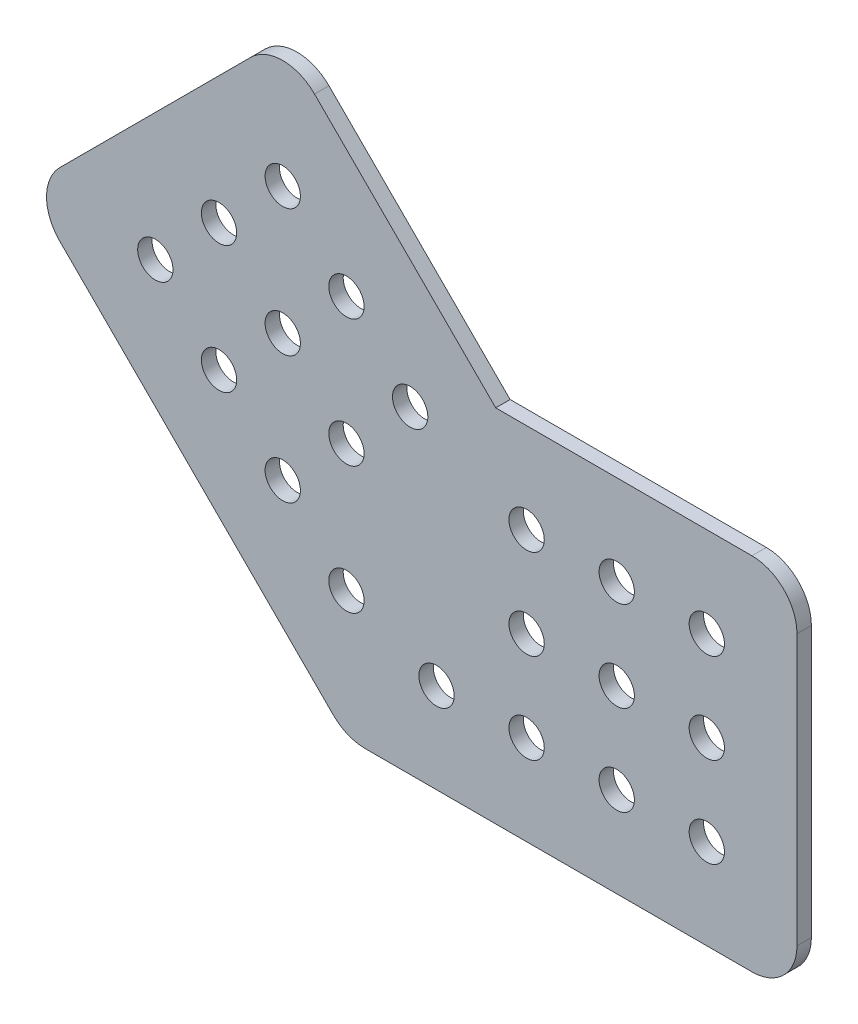
ISO-10303-21;
HEADER;
FILE_DESCRIPTION(('STEP AP214'),'2;1');
FILE_NAME('part.step','',(''),(''),'','','');
FILE_SCHEMA(('AUTOMOTIVE_DESIGN { 1 0 10303 214 1 1 1 1 }'));
ENDSEC;
DATA;
#1=APPLICATION_CONTEXT('core data for automotive mechanical design processes');
#2=APPLICATION_PROTOCOL_DEFINITION('international standard','automotive_design',2000,#1);
#3=PRODUCT_CONTEXT('',#1,'mechanical');
#4=PRODUCT('Part','Part','',(#3));
#5=PRODUCT_RELATED_PRODUCT_CATEGORY('part','',(#4));
#6=PRODUCT_DEFINITION_FORMATION('','',#4);
#7=PRODUCT_DEFINITION_CONTEXT('part definition',#1,'design');
#8=PRODUCT_DEFINITION('design','',#6,#7);
#9=PRODUCT_DEFINITION_SHAPE('','',#8);
#10=(LENGTH_UNIT() NAMED_UNIT(*) SI_UNIT(.MILLI.,.METRE.));
#11=(NAMED_UNIT(*) PLANE_ANGLE_UNIT() SI_UNIT($,.RADIAN.));
#12=(NAMED_UNIT(*) SI_UNIT($,.STERADIAN.) SOLID_ANGLE_UNIT());
#13=UNCERTAINTY_MEASURE_WITH_UNIT(LENGTH_MEASURE(1.E-05),#10,'distance_accuracy_value','');
#14=(GEOMETRIC_REPRESENTATION_CONTEXT(3) GLOBAL_UNCERTAINTY_ASSIGNED_CONTEXT((#13)) GLOBAL_UNIT_ASSIGNED_CONTEXT((#10,
#11,#12)) REPRESENTATION_CONTEXT('',''));
#15=CARTESIAN_POINT('',(0.,0.,0.));
#16=DIRECTION('',(0.,0.,1.));
#17=DIRECTION('',(1.,0.,0.));
#18=AXIS2_PLACEMENT_3D('',#15,#16,#17);
#19=CARTESIAN_POINT('',(-49.161175251051,34.6431769044228,0.));
#20=DIRECTION('',(0.,0.,1.));
#21=DIRECTION('',(1.,0.,0.));
#22=AXIS2_PLACEMENT_3D('',#19,#20,#21);
#23=PLANE('',#22);
#24=CARTESIAN_POINT('',(-63.5108489685532,53.8815367264149,0.));
#25=DIRECTION('',(0.,0.,-1.));
#26=DIRECTION('',(-1.,0.,0.));
#27=AXIS2_PLACEMENT_3D('',#24,#25,#26);
#28=CIRCLE('',#27,2.4892);
#29=CARTESIAN_POINT('',(-66.0000489685532,53.8815367264149,0.));
#30=VERTEX_POINT('',#29);
#31=EDGE_CURVE('E113',#30,#30,#28,.F.);
#32=ORIENTED_EDGE('',*,*,#31,.T.);
#33=EDGE_LOOP('',(#32));
#34=FACE_BOUND('',#33,.T.);
#35=CARTESIAN_POINT('',(-72.4911050896226,62.8617928474842,0.));
#36=DIRECTION('',(0.,0.,-1.));
#37=DIRECTION('',(-1.,0.,0.));
#38=AXIS2_PLACEMENT_3D('',#35,#36,#37);
#39=CIRCLE('',#38,2.4892);
#40=CARTESIAN_POINT('',(-74.9803050896225,62.8617928474842,0.));
#41=VERTEX_POINT('',#40);
#42=EDGE_CURVE('E116',#41,#41,#39,.F.);
#43=ORIENTED_EDGE('',*,*,#42,.T.);
#44=EDGE_LOOP('',(#43));
#45=FACE_BOUND('',#44,.T.);
#46=CARTESIAN_POINT('',(-54.5305928474842,44.9012806053458,0.));
#47=DIRECTION('',(0.,0.,-1.));
#48=DIRECTION('',(-1.,0.,0.));
#49=AXIS2_PLACEMENT_3D('',#46,#47,#48);
#50=CIRCLE('',#49,2.4892);
#51=CARTESIAN_POINT('',(-57.0197928474842,44.9012806053458,0.));
#52=VERTEX_POINT('',#51);
#53=EDGE_CURVE('E269',#52,#52,#50,.F.);
#54=ORIENTED_EDGE('',*,*,#53,.T.);
#55=EDGE_LOOP('',(#54));
#56=FACE_BOUND('',#55,.T.);
#57=CARTESIAN_POINT('',(-72.4911050896223,44.9012806053458,0.));
#58=DIRECTION('',(0.,0.,-1.));
#59=DIRECTION('',(-1.,0.,0.));
#60=AXIS2_PLACEMENT_3D('',#57,#58,#59);
#61=CIRCLE('',#60,2.4892);
#62=CARTESIAN_POINT('',(-74.9803050896223,44.9012806053458,0.));
#63=VERTEX_POINT('',#62);
#64=EDGE_CURVE('E266',#63,#63,#61,.F.);
#65=ORIENTED_EDGE('',*,*,#64,.T.);
#66=EDGE_LOOP('',(#65));
#67=FACE_BOUND('',#66,.T.);
#68=CARTESIAN_POINT('',(-90.4516173317607,44.9012806053458,0.));
#69=DIRECTION('',(0.,0.,-1.));
#70=DIRECTION('',(-1.,0.,0.));
#71=AXIS2_PLACEMENT_3D('',#68,#69,#70);
#72=CIRCLE('',#71,2.4892);
#73=CARTESIAN_POINT('',(-92.9408173317607,44.9012806053458,0.));
#74=VERTEX_POINT('',#73);
#75=EDGE_CURVE('E263',#74,#74,#72,.F.);
#76=ORIENTED_EDGE('',*,*,#75,.T.);
#77=EDGE_LOOP('',(#76));
#78=FACE_BOUND('',#77,.T.);
#79=CARTESIAN_POINT('',(-72.4911050896223,26.9407683632074,0.));
#80=DIRECTION('',(0.,0.,-1.));
#81=DIRECTION('',(-1.,0.,0.));
#82=AXIS2_PLACEMENT_3D('',#79,#80,#81);
#83=CIRCLE('',#82,2.4892);
#84=CARTESIAN_POINT('',(-74.9803050896223,26.9407683632074,0.));
#85=VERTEX_POINT('',#84);
#86=EDGE_CURVE('E260',#85,#85,#83,.F.);
#87=ORIENTED_EDGE('',*,*,#86,.T.);
#88=EDGE_LOOP('',(#87));
#89=FACE_BOUND('',#88,.T.);
#90=CARTESIAN_POINT('',(-63.5108489685532,17.9605122421383,0.));
#91=DIRECTION('',(0.,0.,-1.));
#92=DIRECTION('',(-1.,0.,0.));
#93=AXIS2_PLACEMENT_3D('',#90,#91,#92);
#94=CIRCLE('',#93,2.4892);
#95=CARTESIAN_POINT('',(-66.0000489685532,17.9605122421383,0.));
#96=VERTEX_POINT('',#95);
#97=EDGE_CURVE('E257',#96,#96,#94,.F.);
#98=ORIENTED_EDGE('',*,*,#97,.T.);
#99=EDGE_LOOP('',(#98));
#100=FACE_BOUND('',#99,.T.);
#101=CARTESIAN_POINT('',(-81.4713612106916,35.9210244842765,0.));
#102=DIRECTION('',(0.,0.,-1.));
#103=DIRECTION('',(-1.,0.,0.));
#104=AXIS2_PLACEMENT_3D('',#101,#102,#103);
#105=CIRCLE('',#104,2.4892);
#106=CARTESIAN_POINT('',(-83.9605612106916,35.9210244842765,0.));
#107=VERTEX_POINT('',#106);
#108=EDGE_CURVE('E254',#107,#107,#105,.F.);
#109=ORIENTED_EDGE('',*,*,#108,.T.);
#110=EDGE_LOOP('',(#109));
#111=FACE_BOUND('',#110,.T.);
#112=CARTESIAN_POINT('',(-63.5108489685532,35.9210244842765,0.));
#113=DIRECTION('',(0.,0.,-1.));
#114=DIRECTION('',(-1.,0.,0.));
#115=AXIS2_PLACEMENT_3D('',#112,#113,#114);
#116=CIRCLE('',#115,2.4892);
#117=CARTESIAN_POINT('',(-66.0000489685532,35.9210244842765,0.));
#118=VERTEX_POINT('',#117);
#119=EDGE_CURVE('E251',#118,#118,#116,.F.);
#120=ORIENTED_EDGE('',*,*,#119,.T.);
#121=EDGE_LOOP('',(#120));
#122=FACE_BOUND('',#121,.T.);
#123=CARTESIAN_POINT('',(-81.4713612106916,53.8815367264149,0.));
#124=DIRECTION('',(0.,0.,-1.));
#125=DIRECTION('',(-1.,0.,0.));
#126=AXIS2_PLACEMENT_3D('',#123,#124,#125);
#127=CIRCLE('',#126,2.4892);
#128=CARTESIAN_POINT('',(-83.9605612106916,53.8815367264149,0.));
#129=VERTEX_POINT('',#128);
#130=EDGE_CURVE('E248',#129,#129,#127,.F.);
#131=ORIENTED_EDGE('',*,*,#130,.T.);
#132=EDGE_LOOP('',(#131));
#133=FACE_BOUND('',#132,.T.);
#134=CARTESIAN_POINT('',(-25.4108489685532,38.1,0.));
#135=DIRECTION('',(0.,0.,1.));
#136=DIRECTION('',(1.,0.,0.));
#137=AXIS2_PLACEMENT_3D('',#134,#135,#136);
#138=CIRCLE('',#137,2.4892);
#139=CARTESIAN_POINT('',(-22.9216489685532,38.1,0.));
#140=VERTEX_POINT('',#139);
#141=EDGE_CURVE('E245',#140,#140,#138,.T.);
#142=ORIENTED_EDGE('',*,*,#141,.T.);
#143=EDGE_LOOP('',(#142));
#144=FACE_BOUND('',#143,.T.);
#145=CARTESIAN_POINT('',(-12.7108489685532,25.4,0.));
#146=DIRECTION('',(0.,0.,1.));
#147=DIRECTION('',(1.,0.,0.));
#148=AXIS2_PLACEMENT_3D('',#145,#146,#147);
#149=CIRCLE('',#148,2.4892);
#150=CARTESIAN_POINT('',(-10.2216489685532,25.4,0.));
#151=VERTEX_POINT('',#150);
#152=EDGE_CURVE('E242',#151,#151,#149,.T.);
#153=ORIENTED_EDGE('',*,*,#152,.T.);
#154=EDGE_LOOP('',(#153));
#155=FACE_BOUND('',#154,.T.);
#156=CARTESIAN_POINT('',(-38.1108489685532,25.4,0.));
#157=DIRECTION('',(0.,0.,1.));
#158=DIRECTION('',(1.,0.,0.));
#159=AXIS2_PLACEMENT_3D('',#156,#157,#158);
#160=CIRCLE('',#159,2.4892);
#161=CARTESIAN_POINT('',(-35.6216489685532,25.4,0.));
#162=VERTEX_POINT('',#161);
#163=EDGE_CURVE('E239',#162,#162,#160,.T.);
#164=ORIENTED_EDGE('',*,*,#163,.T.);
#165=EDGE_LOOP('',(#164));
#166=FACE_BOUND('',#165,.T.);
#167=CARTESIAN_POINT('',(-25.4108489685532,12.7,0.));
#168=DIRECTION('',(0.,0.,1.));
#169=DIRECTION('',(1.,0.,0.));
#170=AXIS2_PLACEMENT_3D('',#167,#168,#169);
#171=CIRCLE('',#170,2.4892);
#172=CARTESIAN_POINT('',(-22.9216489685532,12.7,0.));
#173=VERTEX_POINT('',#172);
#174=EDGE_CURVE('E236',#173,#173,#171,.T.);
#175=ORIENTED_EDGE('',*,*,#174,.T.);
#176=EDGE_LOOP('',(#175));
#177=FACE_BOUND('',#176,.T.);
#178=CARTESIAN_POINT('',(-50.8108489685532,12.7,0.));
#179=DIRECTION('',(0.,0.,1.));
#180=DIRECTION('',(1.,0.,0.));
#181=AXIS2_PLACEMENT_3D('',#178,#179,#180);
#182=CIRCLE('',#181,2.4892);
#183=CARTESIAN_POINT('',(-48.3216489685532,12.7,0.));
#184=VERTEX_POINT('',#183);
#185=EDGE_CURVE('E233',#184,#184,#182,.T.);
#186=ORIENTED_EDGE('',*,*,#185,.T.);
#187=EDGE_LOOP('',(#186));
#188=FACE_BOUND('',#187,.T.);
#189=CARTESIAN_POINT('',(-38.1108489685532,12.7,0.));
#190=DIRECTION('',(0.,0.,1.));
#191=DIRECTION('',(1.,0.,0.));
#192=AXIS2_PLACEMENT_3D('',#189,#190,#191);
#193=CIRCLE('',#192,2.4892);
#194=CARTESIAN_POINT('',(-35.6216489685532,12.7,0.));
#195=VERTEX_POINT('',#194);
#196=EDGE_CURVE('E230',#195,#195,#193,.T.);
#197=ORIENTED_EDGE('',*,*,#196,.T.);
#198=EDGE_LOOP('',(#197));
#199=FACE_BOUND('',#198,.T.);
#200=CARTESIAN_POINT('',(-12.7108489685532,12.7,0.));
#201=DIRECTION('',(0.,0.,1.));
#202=DIRECTION('',(1.,0.,0.));
#203=AXIS2_PLACEMENT_3D('',#200,#201,#202);
#204=CIRCLE('',#203,2.4892);
#205=CARTESIAN_POINT('',(-10.2216489685532,12.7,0.));
#206=VERTEX_POINT('',#205);
#207=EDGE_CURVE('E227',#206,#206,#204,.T.);
#208=ORIENTED_EDGE('',*,*,#207,.T.);
#209=EDGE_LOOP('',(#208));
#210=FACE_BOUND('',#209,.T.);
#211=CARTESIAN_POINT('',(-25.4108489685532,25.4,0.));
#212=DIRECTION('',(0.,0.,1.));
#213=DIRECTION('',(1.,0.,0.));
#214=AXIS2_PLACEMENT_3D('',#211,#212,#213);
#215=CIRCLE('',#214,2.4892);
#216=CARTESIAN_POINT('',(-22.9216489685532,25.4,0.));
#217=VERTEX_POINT('',#216);
#218=EDGE_CURVE('E224',#217,#217,#215,.T.);
#219=ORIENTED_EDGE('',*,*,#218,.T.);
#220=EDGE_LOOP('',(#219));
#221=FACE_BOUND('',#220,.T.);
#222=CARTESIAN_POINT('',(-38.1108489685532,38.1,0.));
#223=DIRECTION('',(0.,0.,1.));
#224=DIRECTION('',(1.,0.,0.));
#225=AXIS2_PLACEMENT_3D('',#222,#223,#224);
#226=CIRCLE('',#225,2.4892);
#227=CARTESIAN_POINT('',(-35.6216489685532,38.1,0.));
#228=VERTEX_POINT('',#227);
#229=EDGE_CURVE('E221',#228,#228,#226,.T.);
#230=ORIENTED_EDGE('',*,*,#229,.T.);
#231=EDGE_LOOP('',(#230));
#232=FACE_BOUND('',#231,.T.);
#233=CARTESIAN_POINT('',(-12.7108489685532,38.1,0.));
#234=DIRECTION('',(0.,0.,1.));
#235=DIRECTION('',(1.,0.,0.));
#236=AXIS2_PLACEMENT_3D('',#233,#234,#235);
#237=CIRCLE('',#236,2.4892);
#238=CARTESIAN_POINT('',(-10.2216489685532,38.1,0.));
#239=VERTEX_POINT('',#238);
#240=EDGE_CURVE('E218',#239,#239,#237,.T.);
#241=ORIENTED_EDGE('',*,*,#240,.T.);
#242=EDGE_LOOP('',(#241));
#243=FACE_BOUND('',#242,.T.);
#244=DIRECTION('',(0.,1.,0.));
#245=VECTOR('',#244,1.);
#246=CARTESIAN_POINT('',(0.,0.,0.));
#247=LINE('',#246,#245);
#248=CARTESIAN_POINT('',(0.,6.35,0.));
#249=VERTEX_POINT('',#248);
#250=CARTESIAN_POINT('',(0.,44.45,0.));
#251=VERTEX_POINT('',#250);
#252=EDGE_CURVE('E96',#249,#251,#247,.T.);
#253=ORIENTED_EDGE('',*,*,#252,.F.);
#254=CARTESIAN_POINT('',(-6.35,6.35,0.));
#255=DIRECTION('',(0.,0.,1.));
#256=DIRECTION('',(1.,0.,0.));
#257=AXIS2_PLACEMENT_3D('',#254,#255,#256);
#258=CIRCLE('',#257,6.35);
#259=CARTESIAN_POINT('',(-6.35,0.,0.));
#260=VERTEX_POINT('',#259);
#261=EDGE_CURVE('E110',#260,#249,#258,.T.);
#262=ORIENTED_EDGE('',*,*,#261,.F.);
#263=DIRECTION('',(1.,0.,0.));
#264=VECTOR('',#263,1.);
#265=CARTESIAN_POINT('',(-63.5108489685532,0.,0.));
#266=LINE('',#265,#264);
#267=CARTESIAN_POINT('',(-60.8805928474839,0.,0.));
#268=VERTEX_POINT('',#267);
#269=EDGE_CURVE('E122',#268,#260,#266,.T.);
#270=ORIENTED_EDGE('',*,*,#269,.F.);
#271=CARTESIAN_POINT('',(-60.8805928474839,6.34999999999997,0.));
#272=DIRECTION('',(0.,0.,1.));
#273=DIRECTION('',(1.,0.,0.));
#274=AXIS2_PLACEMENT_3D('',#271,#272,#273);
#275=CIRCLE('',#274,6.35);
#276=CARTESIAN_POINT('',(-65.3707209080185,1.8598719394654,0.));
#277=VERTEX_POINT('',#276);
#278=EDGE_CURVE('E275',#277,#268,#275,.T.);
#279=ORIENTED_EDGE('',*,*,#278,.F.);
#280=DIRECTION('',(0.707106781186548,-0.707106781186547,0.));
#281=VECTOR('',#280,1.);
#282=CARTESIAN_POINT('',(-108.419800953132,44.9089519845786,0.));
#283=LINE('',#282,#281);
#284=CARTESIAN_POINT('',(-103.929672892597,40.418823924044,0.));
#285=VERTEX_POINT('',#284);
#286=EDGE_CURVE('E126',#285,#277,#283,.T.);
#287=ORIENTED_EDGE('',*,*,#286,.F.);
#288=CARTESIAN_POINT('',(-99.4395448320627,44.9089519845786,0.));
#289=DIRECTION('',(0.,0.,1.));
#290=DIRECTION('',(1.,0.,0.));
#291=AXIS2_PLACEMENT_3D('',#288,#289,#290);
#292=CIRCLE('',#291,6.35);
#293=CARTESIAN_POINT('',(-103.929672892597,49.3990800451132,0.));
#294=VERTEX_POINT('',#293);
#295=EDGE_CURVE('E277',#294,#285,#292,.T.);
#296=ORIENTED_EDGE('',*,*,#295,.F.);
#297=DIRECTION('',(-0.707106781186547,-0.707106781186548,0.));
#298=VECTOR('',#297,1.);
#299=CARTESIAN_POINT('',(-72.4987764688553,80.8299764688553,0.));
#300=LINE('',#299,#298);
#301=CARTESIAN_POINT('',(-76.98890452939,76.3398484083206,0.));
#302=VERTEX_POINT('',#301);
#303=EDGE_CURVE('E130',#302,#294,#300,.T.);
#304=ORIENTED_EDGE('',*,*,#303,.F.);
#305=CARTESIAN_POINT('',(-72.4987764688553,71.849720347786,0.));
#306=DIRECTION('',(0.,0.,1.));
#307=DIRECTION('',(1.,0.,0.));
#308=AXIS2_PLACEMENT_3D('',#305,#306,#307);
#309=CIRCLE('',#308,6.35);
#310=CARTESIAN_POINT('',(-68.0086484083207,76.3398484083206,0.));
#311=VERTEX_POINT('',#310);
#312=EDGE_CURVE('E278',#311,#302,#309,.T.);
#313=ORIENTED_EDGE('',*,*,#312,.F.);
#314=DIRECTION('',(-0.707106781186548,0.707106781186547,0.));
#315=VECTOR('',#314,1.);
#316=CARTESIAN_POINT('',(-42.4688,50.8,0.));
#317=LINE('',#316,#315);
#318=CARTESIAN_POINT('',(-42.4688,50.8,0.));
#319=VERTEX_POINT('',#318);
#320=EDGE_CURVE('E134',#319,#311,#317,.T.);
#321=ORIENTED_EDGE('',*,*,#320,.F.);
#322=DIRECTION('',(1.,0.,0.));
#323=VECTOR('',#322,1.);
#324=CARTESIAN_POINT('',(0.,50.8,0.));
#325=LINE('',#324,#323);
#326=CARTESIAN_POINT('',(-6.35,50.8,0.));
#327=VERTEX_POINT('',#326);
#328=EDGE_CURVE('E99',#327,#319,#325,.F.);
#329=ORIENTED_EDGE('',*,*,#328,.F.);
#330=CARTESIAN_POINT('',(-6.35,44.45,0.));
#331=DIRECTION('',(0.,0.,1.));
#332=DIRECTION('',(1.,0.,0.));
#333=AXIS2_PLACEMENT_3D('',#330,#331,#332);
#334=CIRCLE('',#333,6.35);
#335=EDGE_CURVE('E18',#251,#327,#334,.T.);
#336=ORIENTED_EDGE('',*,*,#335,.F.);
#337=EDGE_LOOP('',(#253,#262,#270,#279,#287,#296,#304,#313,#321,#329,#336));
#338=FACE_BOUND('',#337,.T.);
#339=ADVANCED_FACE('F15',(#34,#45,#56,#67,#78,#89,#100,#111,#122,#133,#144,#155,#166,#177,#188,
#199,#210,#221,#232,#243,#338),#23,.F.);
#340=CARTESIAN_POINT('',(-6.35,44.45,0.));
#341=DIRECTION('',(0.,0.,1.));
#342=DIRECTION('',(1.,0.,0.));
#343=AXIS2_PLACEMENT_3D('',#340,#341,#342);
#344=CYLINDRICAL_SURFACE('',#343,6.35);
#345=ORIENTED_EDGE('',*,*,#335,.T.);
#346=DIRECTION('',(0.,0.,1.));
#347=VECTOR('',#346,1.);
#348=CARTESIAN_POINT('',(-6.35,50.8,0.));
#349=LINE('',#348,#347);
#350=CARTESIAN_POINT('',(-6.35,50.8,2.032));
#351=VERTEX_POINT('',#350);
#352=EDGE_CURVE('E102',#351,#327,#349,.F.);
#353=ORIENTED_EDGE('',*,*,#352,.F.);
#354=CARTESIAN_POINT('',(-6.35,44.45,2.032));
#355=DIRECTION('',(0.,0.,1.));
#356=DIRECTION('',(1.,0.,0.));
#357=AXIS2_PLACEMENT_3D('',#354,#355,#356);
#358=CIRCLE('',#357,6.35);
#359=CARTESIAN_POINT('',(0.,44.45,2.032));
#360=VERTEX_POINT('',#359);
#361=EDGE_CURVE('E107',#360,#351,#358,.T.);
#362=ORIENTED_EDGE('',*,*,#361,.F.);
#363=DIRECTION('',(0.,0.,-1.));
#364=VECTOR('',#363,1.);
#365=CARTESIAN_POINT('',(0.,44.45,0.));
#366=LINE('',#365,#364);
#367=EDGE_CURVE('E104',#251,#360,#366,.F.);
#368=ORIENTED_EDGE('',*,*,#367,.F.);
#369=EDGE_LOOP('',(#345,#353,#362,#368));
#370=FACE_BOUND('',#369,.T.);
#371=ADVANCED_FACE('F105',(#370),#344,.T.);
#372=CARTESIAN_POINT('',(0.,50.8,0.));
#373=DIRECTION('',(0.,1.,0.));
#374=DIRECTION('',(0.,0.,1.));
#375=AXIS2_PLACEMENT_3D('',#372,#373,#374);
#376=PLANE('',#375);
#377=DIRECTION('',(0.,0.,1.));
#378=VECTOR('',#377,1.);
#379=CARTESIAN_POINT('',(-42.4688,50.8,0.));
#380=LINE('',#379,#378);
#381=CARTESIAN_POINT('',(-42.4688,50.8,2.032));
#382=VERTEX_POINT('',#381);
#383=EDGE_CURVE('E137',#382,#319,#380,.F.);
#384=ORIENTED_EDGE('',*,*,#383,.F.);
#385=DIRECTION('',(1.,0.,0.));
#386=VECTOR('',#385,1.);
#387=CARTESIAN_POINT('',(-49.161175251051,50.8,2.032));
#388=LINE('',#387,#386);
#389=EDGE_CURVE('E217',#351,#382,#388,.F.);
#390=ORIENTED_EDGE('',*,*,#389,.F.);
#391=ORIENTED_EDGE('',*,*,#352,.T.);
#392=ORIENTED_EDGE('',*,*,#328,.T.);
#393=EDGE_LOOP('',(#384,#390,#391,#392));
#394=FACE_BOUND('',#393,.T.);
#395=ADVANCED_FACE('F299',(#394),#376,.T.);
#396=CARTESIAN_POINT('',(-42.4688,50.8,0.));
#397=DIRECTION('',(0.707106781186547,0.707106781186548,0.));
#398=DIRECTION('',(-0.707106781186548,0.707106781186547,0.));
#399=AXIS2_PLACEMENT_3D('',#396,#397,#398);
#400=PLANE('',#399);
#401=ORIENTED_EDGE('',*,*,#383,.T.);
#402=ORIENTED_EDGE('',*,*,#320,.T.);
#403=DIRECTION('',(0.,0.,1.));
#404=VECTOR('',#403,1.);
#405=CARTESIAN_POINT('',(-68.0086484083207,76.3398484083206,0.));
#406=LINE('',#405,#404);
#407=CARTESIAN_POINT('',(-68.0086484083207,76.3398484083206,2.032));
#408=VERTEX_POINT('',#407);
#409=EDGE_CURVE('E136',#408,#311,#406,.F.);
#410=ORIENTED_EDGE('',*,*,#409,.F.);
#411=DIRECTION('',(-0.707106781186547,0.707106781186548,0.));
#412=VECTOR('',#411,1.);
#413=CARTESIAN_POINT('',(-42.4688,50.8,2.032));
#414=LINE('',#413,#412);
#415=EDGE_CURVE('E215',#382,#408,#414,.T.);
#416=ORIENTED_EDGE('',*,*,#415,.F.);
#417=EDGE_LOOP('',(#401,#402,#410,#416));
#418=FACE_BOUND('',#417,.T.);
#419=ADVANCED_FACE('F294',(#418),#400,.T.);
#420=CARTESIAN_POINT('',(-72.4987764688553,71.849720347786,0.));
#421=DIRECTION('',(0.,0.,1.));
#422=DIRECTION('',(1.,0.,0.));
#423=AXIS2_PLACEMENT_3D('',#420,#421,#422);
#424=CYLINDRICAL_SURFACE('',#423,6.35);
#425=ORIENTED_EDGE('',*,*,#312,.T.);
#426=DIRECTION('',(0.,0.,1.));
#427=VECTOR('',#426,1.);
#428=CARTESIAN_POINT('',(-76.98890452939,76.3398484083207,0.));
#429=LINE('',#428,#427);
#430=CARTESIAN_POINT('',(-76.98890452939,76.3398484083207,2.032));
#431=VERTEX_POINT('',#430);
#432=EDGE_CURVE('E133',#431,#302,#429,.F.);
#433=ORIENTED_EDGE('',*,*,#432,.F.);
#434=CARTESIAN_POINT('',(-72.4987764688553,71.849720347786,2.032));
#435=DIRECTION('',(0.,0.,1.));
#436=DIRECTION('',(1.,0.,0.));
#437=AXIS2_PLACEMENT_3D('',#434,#435,#436);
#438=CIRCLE('',#437,6.35);
#439=EDGE_CURVE('E212',#408,#431,#438,.T.);
#440=ORIENTED_EDGE('',*,*,#439,.F.);
#441=ORIENTED_EDGE('',*,*,#409,.T.);
#442=EDGE_LOOP('',(#425,#433,#440,#441));
#443=FACE_BOUND('',#442,.T.);
#444=ADVANCED_FACE('F308',(#443),#424,.T.);
#445=CARTESIAN_POINT('',(-72.4987764688553,80.8299764688553,0.));
#446=DIRECTION('',(-0.707106781186548,0.707106781186547,0.));
#447=DIRECTION('',(-0.707106781186547,-0.707106781186548,0.));
#448=AXIS2_PLACEMENT_3D('',#445,#446,#447);
#449=PLANE('',#448);
#450=ORIENTED_EDGE('',*,*,#432,.T.);
#451=ORIENTED_EDGE('',*,*,#303,.T.);
#452=DIRECTION('',(0.,0.,1.));
#453=VECTOR('',#452,1.);
#454=CARTESIAN_POINT('',(-103.929672892597,49.3990800451132,0.));
#455=LINE('',#454,#453);
#456=CARTESIAN_POINT('',(-103.929672892597,49.3990800451132,2.032));
#457=VERTEX_POINT('',#456);
#458=EDGE_CURVE('E132',#457,#294,#455,.F.);
#459=ORIENTED_EDGE('',*,*,#458,.F.);
#460=DIRECTION('',(-0.707106781186547,-0.707106781186547,0.));
#461=VECTOR('',#460,1.);
#462=CARTESIAN_POINT('',(-76.98890452939,76.3398484083207,2.032));
#463=LINE('',#462,#461);
#464=EDGE_CURVE('E211',#431,#457,#463,.T.);
#465=ORIENTED_EDGE('',*,*,#464,.F.);
#466=EDGE_LOOP('',(#450,#451,#459,#465));
#467=FACE_BOUND('',#466,.T.);
#468=ADVANCED_FACE('F306',(#467),#449,.T.);
#469=CARTESIAN_POINT('',(-99.4395448320627,44.9089519845786,0.));
#470=DIRECTION('',(0.,0.,1.));
#471=DIRECTION('',(1.,0.,0.));
#472=AXIS2_PLACEMENT_3D('',#469,#470,#471);
#473=CYLINDRICAL_SURFACE('',#472,6.35);
#474=ORIENTED_EDGE('',*,*,#295,.T.);
#475=DIRECTION('',(0.,0.,1.));
#476=VECTOR('',#475,1.);
#477=CARTESIAN_POINT('',(-103.929672892597,40.418823924044,0.));
#478=LINE('',#477,#476);
#479=CARTESIAN_POINT('',(-103.929672892597,40.418823924044,2.032));
#480=VERTEX_POINT('',#479);
#481=EDGE_CURVE('E129',#480,#285,#478,.F.);
#482=ORIENTED_EDGE('',*,*,#481,.F.);
#483=CARTESIAN_POINT('',(-99.4395448320627,44.9089519845786,2.032));
#484=DIRECTION('',(0.,0.,1.));
#485=DIRECTION('',(1.,0.,0.));
#486=AXIS2_PLACEMENT_3D('',#483,#484,#485);
#487=CIRCLE('',#486,6.35);
#488=EDGE_CURVE('E208',#457,#480,#487,.T.);
#489=ORIENTED_EDGE('',*,*,#488,.F.);
#490=ORIENTED_EDGE('',*,*,#458,.T.);
#491=EDGE_LOOP('',(#474,#482,#489,#490));
#492=FACE_BOUND('',#491,.T.);
#493=ADVANCED_FACE('F329',(#492),#473,.T.);
#494=CARTESIAN_POINT('',(-108.419800953132,44.9089519845786,0.));
#495=DIRECTION('',(-0.707106781186547,-0.707106781186548,0.));
#496=DIRECTION('',(0.707106781186548,-0.707106781186547,0.));
#497=AXIS2_PLACEMENT_3D('',#494,#495,#496);
#498=PLANE('',#497);
#499=ORIENTED_EDGE('',*,*,#481,.T.);
#500=ORIENTED_EDGE('',*,*,#286,.T.);
#501=DIRECTION('',(0.,0.,1.));
#502=VECTOR('',#501,1.);
#503=CARTESIAN_POINT('',(-65.3707209080185,1.85987193946545,0.));
#504=LINE('',#503,#502);
#505=CARTESIAN_POINT('',(-65.3707209080185,1.8598719394654,2.032));
#506=VERTEX_POINT('',#505);
#507=EDGE_CURVE('E128',#506,#277,#504,.F.);
#508=ORIENTED_EDGE('',*,*,#507,.F.);
#509=DIRECTION('',(0.70710678118655,-0.707106781186545,0.));
#510=VECTOR('',#509,1.);
#511=CARTESIAN_POINT('',(-103.929672892597,40.4188239240439,2.032));
#512=LINE('',#511,#510);
#513=EDGE_CURVE('E207',#480,#506,#512,.T.);
#514=ORIENTED_EDGE('',*,*,#513,.F.);
#515=EDGE_LOOP('',(#499,#500,#508,#514));
#516=FACE_BOUND('',#515,.T.);
#517=ADVANCED_FACE('F345',(#516),#498,.T.);
#518=CARTESIAN_POINT('',(-60.8805928474839,6.34999999999997,0.));
#519=DIRECTION('',(0.,0.,1.));
#520=DIRECTION('',(1.,0.,0.));
#521=AXIS2_PLACEMENT_3D('',#518,#519,#520);
#522=CYLINDRICAL_SURFACE('',#521,6.35);
#523=ORIENTED_EDGE('',*,*,#278,.T.);
#524=DIRECTION('',(0.,0.,1.));
#525=VECTOR('',#524,1.);
#526=CARTESIAN_POINT('',(-60.8805928474839,0.,0.));
#527=LINE('',#526,#525);
#528=CARTESIAN_POINT('',(-60.8805928474839,0.,2.032));
#529=VERTEX_POINT('',#528);
#530=EDGE_CURVE('E125',#529,#268,#527,.F.);
#531=ORIENTED_EDGE('',*,*,#530,.F.);
#532=CARTESIAN_POINT('',(-60.8805928474839,6.34999999999997,2.032));
#533=DIRECTION('',(0.,0.,1.));
#534=DIRECTION('',(1.,0.,0.));
#535=AXIS2_PLACEMENT_3D('',#532,#533,#534);
#536=CIRCLE('',#535,6.35);
#537=EDGE_CURVE('E204',#506,#529,#536,.T.);
#538=ORIENTED_EDGE('',*,*,#537,.F.);
#539=ORIENTED_EDGE('',*,*,#507,.T.);
#540=EDGE_LOOP('',(#523,#531,#538,#539));
#541=FACE_BOUND('',#540,.T.);
#542=ADVANCED_FACE('F344',(#541),#522,.T.);
#543=CARTESIAN_POINT('',(-63.5108489685532,0.,0.));
#544=DIRECTION('',(0.,-1.,0.));
#545=DIRECTION('',(1.,0.,0.));
#546=AXIS2_PLACEMENT_3D('',#543,#544,#545);
#547=PLANE('',#546);
#548=ORIENTED_EDGE('',*,*,#530,.T.);
#549=ORIENTED_EDGE('',*,*,#269,.T.);
#550=DIRECTION('',(0.,0.,1.));
#551=VECTOR('',#550,1.);
#552=CARTESIAN_POINT('',(-6.35,0.,0.));
#553=LINE('',#552,#551);
#554=CARTESIAN_POINT('',(-6.35,0.,2.032));
#555=VERTEX_POINT('',#554);
#556=EDGE_CURVE('E124',#555,#260,#553,.F.);
#557=ORIENTED_EDGE('',*,*,#556,.F.);
#558=DIRECTION('',(1.,0.,0.));
#559=VECTOR('',#558,1.);
#560=CARTESIAN_POINT('',(-49.161175251051,0.,2.032));
#561=LINE('',#560,#559);
#562=EDGE_CURVE('E203',#529,#555,#561,.T.);
#563=ORIENTED_EDGE('',*,*,#562,.F.);
#564=EDGE_LOOP('',(#548,#549,#557,#563));
#565=FACE_BOUND('',#564,.T.);
#566=ADVANCED_FACE('F340',(#565),#547,.T.);
#567=CARTESIAN_POINT('',(-6.35,6.35,0.));
#568=DIRECTION('',(0.,0.,1.));
#569=DIRECTION('',(1.,0.,0.));
#570=AXIS2_PLACEMENT_3D('',#567,#568,#569);
#571=CYLINDRICAL_SURFACE('',#570,6.35);
#572=ORIENTED_EDGE('',*,*,#261,.T.);
#573=DIRECTION('',(0.,0.,-1.));
#574=VECTOR('',#573,1.);
#575=CARTESIAN_POINT('',(0.,6.35,0.));
#576=LINE('',#575,#574);
#577=CARTESIAN_POINT('',(0.,6.35,2.032));
#578=VERTEX_POINT('',#577);
#579=EDGE_CURVE('E33',#578,#249,#576,.T.);
#580=ORIENTED_EDGE('',*,*,#579,.F.);
#581=CARTESIAN_POINT('',(-6.35,6.35,2.032));
#582=DIRECTION('',(0.,0.,1.));
#583=DIRECTION('',(1.,0.,0.));
#584=AXIS2_PLACEMENT_3D('',#581,#582,#583);
#585=CIRCLE('',#584,6.35);
#586=EDGE_CURVE('E200',#555,#578,#585,.T.);
#587=ORIENTED_EDGE('',*,*,#586,.F.);
#588=ORIENTED_EDGE('',*,*,#556,.T.);
#589=EDGE_LOOP('',(#572,#580,#587,#588));
#590=FACE_BOUND('',#589,.T.);
#591=ADVANCED_FACE('F338',(#590),#571,.T.);
#592=CARTESIAN_POINT('',(0.,0.,0.));
#593=DIRECTION('',(1.,0.,0.));
#594=DIRECTION('',(0.,0.,-1.));
#595=AXIS2_PLACEMENT_3D('',#592,#593,#594);
#596=PLANE('',#595);
#597=ORIENTED_EDGE('',*,*,#579,.T.);
#598=ORIENTED_EDGE('',*,*,#252,.T.);
#599=ORIENTED_EDGE('',*,*,#367,.T.);
#600=DIRECTION('',(0.,1.,0.));
#601=VECTOR('',#600,1.);
#602=CARTESIAN_POINT('',(0.,34.6431769044228,2.032));
#603=LINE('',#602,#601);
#604=EDGE_CURVE('E199',#578,#360,#603,.T.);
#605=ORIENTED_EDGE('',*,*,#604,.F.);
#606=EDGE_LOOP('',(#597,#598,#599,#605));
#607=FACE_BOUND('',#606,.T.);
#608=ADVANCED_FACE('F112',(#607),#596,.T.);
#609=CARTESIAN_POINT('',(-63.5108489685532,53.8815367264149,-133.217648275596));
#610=DIRECTION('',(0.,0.,-1.));
#611=DIRECTION('',(-1.,0.,0.));
#612=AXIS2_PLACEMENT_3D('',#609,#610,#611);
#613=CYLINDRICAL_SURFACE('',#612,2.4892);
#614=CARTESIAN_POINT('',(-63.5108489685532,53.8815367264149,2.03200000000001));
#615=DIRECTION('',(0.,0.,-1.));
#616=DIRECTION('',(-1.,0.,0.));
#617=AXIS2_PLACEMENT_3D('',#614,#615,#616);
#618=CIRCLE('',#617,2.4892);
#619=CARTESIAN_POINT('',(-66.0000489685532,53.8815367264149,2.03200000000001));
#620=VERTEX_POINT('',#619);
#621=EDGE_CURVE('E196',#620,#620,#618,.T.);
#622=ORIENTED_EDGE('',*,*,#621,.F.);
#623=EDGE_LOOP('',(#622));
#624=FACE_BOUND('',#623,.T.);
#625=ORIENTED_EDGE('',*,*,#31,.F.);
#626=EDGE_LOOP('',(#625));
#627=FACE_BOUND('',#626,.T.);
#628=ADVANCED_FACE('F437',(#624,#627),#613,.F.);
#629=CARTESIAN_POINT('',(-72.4911050896226,62.8617928474842,-133.217648275596));
#630=DIRECTION('',(0.,0.,-1.));
#631=DIRECTION('',(-1.,0.,0.));
#632=AXIS2_PLACEMENT_3D('',#629,#630,#631);
#633=CYLINDRICAL_SURFACE('',#632,2.4892);
#634=CARTESIAN_POINT('',(-72.4911050896226,62.8617928474842,2.03200000000001));
#635=DIRECTION('',(0.,0.,-1.));
#636=DIRECTION('',(-1.,0.,0.));
#637=AXIS2_PLACEMENT_3D('',#634,#635,#636);
#638=CIRCLE('',#637,2.4892);
#639=CARTESIAN_POINT('',(-74.9803050896225,62.8617928474842,2.03200000000001));
#640=VERTEX_POINT('',#639);
#641=EDGE_CURVE('E193',#640,#640,#638,.T.);
#642=ORIENTED_EDGE('',*,*,#641,.F.);
#643=EDGE_LOOP('',(#642));
#644=FACE_BOUND('',#643,.T.);
#645=ORIENTED_EDGE('',*,*,#42,.F.);
#646=EDGE_LOOP('',(#645));
#647=FACE_BOUND('',#646,.T.);
#648=ADVANCED_FACE('F433',(#644,#647),#633,.F.);
#649=CARTESIAN_POINT('',(-54.5305928474842,44.9012806053458,-133.217648275596));
#650=DIRECTION('',(0.,0.,-1.));
#651=DIRECTION('',(-1.,0.,0.));
#652=AXIS2_PLACEMENT_3D('',#649,#650,#651);
#653=CYLINDRICAL_SURFACE('',#652,2.4892);
#654=CARTESIAN_POINT('',(-54.5305928474842,44.9012806053458,2.03200000000001));
#655=DIRECTION('',(0.,0.,-1.));
#656=DIRECTION('',(-1.,0.,0.));
#657=AXIS2_PLACEMENT_3D('',#654,#655,#656);
#658=CIRCLE('',#657,2.4892);
#659=CARTESIAN_POINT('',(-57.0197928474842,44.9012806053458,2.03200000000001));
#660=VERTEX_POINT('',#659);
#661=EDGE_CURVE('E190',#660,#660,#658,.T.);
#662=ORIENTED_EDGE('',*,*,#661,.F.);
#663=EDGE_LOOP('',(#662));
#664=FACE_BOUND('',#663,.T.);
#665=ORIENTED_EDGE('',*,*,#53,.F.);
#666=EDGE_LOOP('',(#665));
#667=FACE_BOUND('',#666,.T.);
#668=ADVANCED_FACE('F429',(#664,#667),#653,.F.);
#669=CARTESIAN_POINT('',(-72.4911050896223,44.9012806053458,-133.217648275596));
#670=DIRECTION('',(0.,0.,-1.));
#671=DIRECTION('',(-1.,0.,0.));
#672=AXIS2_PLACEMENT_3D('',#669,#670,#671);
#673=CYLINDRICAL_SURFACE('',#672,2.4892);
#674=CARTESIAN_POINT('',(-72.4911050896223,44.9012806053458,2.03200000000001));
#675=DIRECTION('',(0.,0.,-1.));
#676=DIRECTION('',(-1.,0.,0.));
#677=AXIS2_PLACEMENT_3D('',#674,#675,#676);
#678=CIRCLE('',#677,2.4892);
#679=CARTESIAN_POINT('',(-74.9803050896223,44.9012806053458,2.03200000000001));
#680=VERTEX_POINT('',#679);
#681=EDGE_CURVE('E187',#680,#680,#678,.T.);
#682=ORIENTED_EDGE('',*,*,#681,.F.);
#683=EDGE_LOOP('',(#682));
#684=FACE_BOUND('',#683,.T.);
#685=ORIENTED_EDGE('',*,*,#64,.F.);
#686=EDGE_LOOP('',(#685));
#687=FACE_BOUND('',#686,.T.);
#688=ADVANCED_FACE('F425',(#684,#687),#673,.F.);
#689=CARTESIAN_POINT('',(-90.4516173317607,44.9012806053458,-133.217648275596));
#690=DIRECTION('',(0.,0.,-1.));
#691=DIRECTION('',(-1.,0.,0.));
#692=AXIS2_PLACEMENT_3D('',#689,#690,#691);
#693=CYLINDRICAL_SURFACE('',#692,2.4892);
#694=CARTESIAN_POINT('',(-90.4516173317607,44.9012806053458,2.03200000000001));
#695=DIRECTION('',(0.,0.,-1.));
#696=DIRECTION('',(-1.,0.,0.));
#697=AXIS2_PLACEMENT_3D('',#694,#695,#696);
#698=CIRCLE('',#697,2.4892);
#699=CARTESIAN_POINT('',(-92.9408173317607,44.9012806053458,2.03200000000001));
#700=VERTEX_POINT('',#699);
#701=EDGE_CURVE('E184',#700,#700,#698,.T.);
#702=ORIENTED_EDGE('',*,*,#701,.F.);
#703=EDGE_LOOP('',(#702));
#704=FACE_BOUND('',#703,.T.);
#705=ORIENTED_EDGE('',*,*,#75,.F.);
#706=EDGE_LOOP('',(#705));
#707=FACE_BOUND('',#706,.T.);
#708=ADVANCED_FACE('F421',(#704,#707),#693,.F.);
#709=CARTESIAN_POINT('',(-72.4911050896223,26.9407683632074,-133.217648275596));
#710=DIRECTION('',(0.,0.,-1.));
#711=DIRECTION('',(-1.,0.,0.));
#712=AXIS2_PLACEMENT_3D('',#709,#710,#711);
#713=CYLINDRICAL_SURFACE('',#712,2.4892);
#714=CARTESIAN_POINT('',(-72.4911050896223,26.9407683632074,2.03200000000001));
#715=DIRECTION('',(0.,0.,-1.));
#716=DIRECTION('',(-1.,0.,0.));
#717=AXIS2_PLACEMENT_3D('',#714,#715,#716);
#718=CIRCLE('',#717,2.4892);
#719=CARTESIAN_POINT('',(-74.9803050896223,26.9407683632074,2.03200000000001));
#720=VERTEX_POINT('',#719);
#721=EDGE_CURVE('E181',#720,#720,#718,.T.);
#722=ORIENTED_EDGE('',*,*,#721,.F.);
#723=EDGE_LOOP('',(#722));
#724=FACE_BOUND('',#723,.T.);
#725=ORIENTED_EDGE('',*,*,#86,.F.);
#726=EDGE_LOOP('',(#725));
#727=FACE_BOUND('',#726,.T.);
#728=ADVANCED_FACE('F417',(#724,#727),#713,.F.);
#729=CARTESIAN_POINT('',(-63.5108489685532,17.9605122421383,-133.217648275596));
#730=DIRECTION('',(0.,0.,-1.));
#731=DIRECTION('',(-1.,0.,0.));
#732=AXIS2_PLACEMENT_3D('',#729,#730,#731);
#733=CYLINDRICAL_SURFACE('',#732,2.4892);
#734=CARTESIAN_POINT('',(-63.5108489685532,17.9605122421383,2.03200000000001));
#735=DIRECTION('',(0.,0.,-1.));
#736=DIRECTION('',(-1.,0.,0.));
#737=AXIS2_PLACEMENT_3D('',#734,#735,#736);
#738=CIRCLE('',#737,2.4892);
#739=CARTESIAN_POINT('',(-66.0000489685532,17.9605122421383,2.03200000000001));
#740=VERTEX_POINT('',#739);
#741=EDGE_CURVE('E178',#740,#740,#738,.T.);
#742=ORIENTED_EDGE('',*,*,#741,.F.);
#743=EDGE_LOOP('',(#742));
#744=FACE_BOUND('',#743,.T.);
#745=ORIENTED_EDGE('',*,*,#97,.F.);
#746=EDGE_LOOP('',(#745));
#747=FACE_BOUND('',#746,.T.);
#748=ADVANCED_FACE('F413',(#744,#747),#733,.F.);
#749=CARTESIAN_POINT('',(-81.4713612106916,35.9210244842765,-133.217648275596));
#750=DIRECTION('',(0.,0.,-1.));
#751=DIRECTION('',(-1.,0.,0.));
#752=AXIS2_PLACEMENT_3D('',#749,#750,#751);
#753=CYLINDRICAL_SURFACE('',#752,2.4892);
#754=CARTESIAN_POINT('',(-81.4713612106916,35.9210244842765,2.03200000000001));
#755=DIRECTION('',(0.,0.,-1.));
#756=DIRECTION('',(-1.,0.,0.));
#757=AXIS2_PLACEMENT_3D('',#754,#755,#756);
#758=CIRCLE('',#757,2.4892);
#759=CARTESIAN_POINT('',(-83.9605612106916,35.9210244842765,2.03200000000001));
#760=VERTEX_POINT('',#759);
#761=EDGE_CURVE('E175',#760,#760,#758,.T.);
#762=ORIENTED_EDGE('',*,*,#761,.F.);
#763=EDGE_LOOP('',(#762));
#764=FACE_BOUND('',#763,.T.);
#765=ORIENTED_EDGE('',*,*,#108,.F.);
#766=EDGE_LOOP('',(#765));
#767=FACE_BOUND('',#766,.T.);
#768=ADVANCED_FACE('F409',(#764,#767),#753,.F.);
#769=CARTESIAN_POINT('',(-63.5108489685532,35.9210244842765,-133.217648275596));
#770=DIRECTION('',(0.,0.,-1.));
#771=DIRECTION('',(-1.,0.,0.));
#772=AXIS2_PLACEMENT_3D('',#769,#770,#771);
#773=CYLINDRICAL_SURFACE('',#772,2.4892);
#774=CARTESIAN_POINT('',(-63.5108489685532,35.9210244842765,2.03200000000001));
#775=DIRECTION('',(0.,0.,-1.));
#776=DIRECTION('',(-1.,0.,0.));
#777=AXIS2_PLACEMENT_3D('',#774,#775,#776);
#778=CIRCLE('',#777,2.4892);
#779=CARTESIAN_POINT('',(-66.0000489685532,35.9210244842765,2.03200000000001));
#780=VERTEX_POINT('',#779);
#781=EDGE_CURVE('E172',#780,#780,#778,.T.);
#782=ORIENTED_EDGE('',*,*,#781,.F.);
#783=EDGE_LOOP('',(#782));
#784=FACE_BOUND('',#783,.T.);
#785=ORIENTED_EDGE('',*,*,#119,.F.);
#786=EDGE_LOOP('',(#785));
#787=FACE_BOUND('',#786,.T.);
#788=ADVANCED_FACE('F405',(#784,#787),#773,.F.);
#789=CARTESIAN_POINT('',(-81.4713612106916,53.8815367264149,-133.217648275596));
#790=DIRECTION('',(0.,0.,-1.));
#791=DIRECTION('',(-1.,0.,0.));
#792=AXIS2_PLACEMENT_3D('',#789,#790,#791);
#793=CYLINDRICAL_SURFACE('',#792,2.4892);
#794=CARTESIAN_POINT('',(-81.4713612106916,53.8815367264149,2.03200000000001));
#795=DIRECTION('',(0.,0.,-1.));
#796=DIRECTION('',(-1.,0.,0.));
#797=AXIS2_PLACEMENT_3D('',#794,#795,#796);
#798=CIRCLE('',#797,2.4892);
#799=CARTESIAN_POINT('',(-83.9605612106916,53.8815367264149,2.03200000000001));
#800=VERTEX_POINT('',#799);
#801=EDGE_CURVE('E169',#800,#800,#798,.T.);
#802=ORIENTED_EDGE('',*,*,#801,.F.);
#803=EDGE_LOOP('',(#802));
#804=FACE_BOUND('',#803,.T.);
#805=ORIENTED_EDGE('',*,*,#130,.F.);
#806=EDGE_LOOP('',(#805));
#807=FACE_BOUND('',#806,.T.);
#808=ADVANCED_FACE('F401',(#804,#807),#793,.F.);
#809=CARTESIAN_POINT('',(-25.4108489685532,38.1,-133.217648275596));
#810=DIRECTION('',(0.,0.,1.));
#811=DIRECTION('',(1.,0.,0.));
#812=AXIS2_PLACEMENT_3D('',#809,#810,#811);
#813=CYLINDRICAL_SURFACE('',#812,2.4892);
#814=CARTESIAN_POINT('',(-25.4108489685532,38.1,2.03200000000001));
#815=DIRECTION('',(0.,0.,1.));
#816=DIRECTION('',(1.,0.,0.));
#817=AXIS2_PLACEMENT_3D('',#814,#815,#816);
#818=CIRCLE('',#817,2.4892);
#819=CARTESIAN_POINT('',(-22.9216489685532,38.1,2.03200000000001));
#820=VERTEX_POINT('',#819);
#821=EDGE_CURVE('E166',#820,#820,#818,.F.);
#822=ORIENTED_EDGE('',*,*,#821,.F.);
#823=EDGE_LOOP('',(#822));
#824=FACE_BOUND('',#823,.T.);
#825=ORIENTED_EDGE('',*,*,#141,.F.);
#826=EDGE_LOOP('',(#825));
#827=FACE_BOUND('',#826,.T.);
#828=ADVANCED_FACE('F397',(#824,#827),#813,.F.);
#829=CARTESIAN_POINT('',(-12.7108489685532,25.4,-133.217648275596));
#830=DIRECTION('',(0.,0.,1.));
#831=DIRECTION('',(1.,0.,0.));
#832=AXIS2_PLACEMENT_3D('',#829,#830,#831);
#833=CYLINDRICAL_SURFACE('',#832,2.4892);
#834=CARTESIAN_POINT('',(-12.7108489685532,25.4,2.03200000000001));
#835=DIRECTION('',(0.,0.,1.));
#836=DIRECTION('',(1.,0.,0.));
#837=AXIS2_PLACEMENT_3D('',#834,#835,#836);
#838=CIRCLE('',#837,2.4892);
#839=CARTESIAN_POINT('',(-10.2216489685532,25.4,2.03200000000001));
#840=VERTEX_POINT('',#839);
#841=EDGE_CURVE('E163',#840,#840,#838,.F.);
#842=ORIENTED_EDGE('',*,*,#841,.F.);
#843=EDGE_LOOP('',(#842));
#844=FACE_BOUND('',#843,.T.);
#845=ORIENTED_EDGE('',*,*,#152,.F.);
#846=EDGE_LOOP('',(#845));
#847=FACE_BOUND('',#846,.T.);
#848=ADVANCED_FACE('F393',(#844,#847),#833,.F.);
#849=CARTESIAN_POINT('',(-38.1108489685532,25.4,-133.217648275596));
#850=DIRECTION('',(0.,0.,1.));
#851=DIRECTION('',(1.,0.,0.));
#852=AXIS2_PLACEMENT_3D('',#849,#850,#851);
#853=CYLINDRICAL_SURFACE('',#852,2.4892);
#854=CARTESIAN_POINT('',(-38.1108489685532,25.4,2.03200000000001));
#855=DIRECTION('',(0.,0.,1.));
#856=DIRECTION('',(1.,0.,0.));
#857=AXIS2_PLACEMENT_3D('',#854,#855,#856);
#858=CIRCLE('',#857,2.4892);
#859=CARTESIAN_POINT('',(-35.6216489685532,25.4,2.03200000000001));
#860=VERTEX_POINT('',#859);
#861=EDGE_CURVE('E160',#860,#860,#858,.F.);
#862=ORIENTED_EDGE('',*,*,#861,.F.);
#863=EDGE_LOOP('',(#862));
#864=FACE_BOUND('',#863,.T.);
#865=ORIENTED_EDGE('',*,*,#163,.F.);
#866=EDGE_LOOP('',(#865));
#867=FACE_BOUND('',#866,.T.);
#868=ADVANCED_FACE('F389',(#864,#867),#853,.F.);
#869=CARTESIAN_POINT('',(-25.4108489685532,12.7,-133.217648275596));
#870=DIRECTION('',(0.,0.,1.));
#871=DIRECTION('',(1.,0.,0.));
#872=AXIS2_PLACEMENT_3D('',#869,#870,#871);
#873=CYLINDRICAL_SURFACE('',#872,2.4892);
#874=CARTESIAN_POINT('',(-25.4108489685532,12.7,2.03200000000001));
#875=DIRECTION('',(0.,0.,1.));
#876=DIRECTION('',(1.,0.,0.));
#877=AXIS2_PLACEMENT_3D('',#874,#875,#876);
#878=CIRCLE('',#877,2.4892);
#879=CARTESIAN_POINT('',(-22.9216489685532,12.7,2.03200000000001));
#880=VERTEX_POINT('',#879);
#881=EDGE_CURVE('E157',#880,#880,#878,.F.);
#882=ORIENTED_EDGE('',*,*,#881,.F.);
#883=EDGE_LOOP('',(#882));
#884=FACE_BOUND('',#883,.T.);
#885=ORIENTED_EDGE('',*,*,#174,.F.);
#886=EDGE_LOOP('',(#885));
#887=FACE_BOUND('',#886,.T.);
#888=ADVANCED_FACE('F385',(#884,#887),#873,.F.);
#889=CARTESIAN_POINT('',(-50.8108489685532,12.7,-133.217648275596));
#890=DIRECTION('',(0.,0.,1.));
#891=DIRECTION('',(1.,0.,0.));
#892=AXIS2_PLACEMENT_3D('',#889,#890,#891);
#893=CYLINDRICAL_SURFACE('',#892,2.4892);
#894=CARTESIAN_POINT('',(-50.8108489685532,12.7,2.03200000000001));
#895=DIRECTION('',(0.,0.,1.));
#896=DIRECTION('',(1.,0.,0.));
#897=AXIS2_PLACEMENT_3D('',#894,#895,#896);
#898=CIRCLE('',#897,2.4892);
#899=CARTESIAN_POINT('',(-48.3216489685532,12.7,2.03200000000001));
#900=VERTEX_POINT('',#899);
#901=EDGE_CURVE('E154',#900,#900,#898,.F.);
#902=ORIENTED_EDGE('',*,*,#901,.F.);
#903=EDGE_LOOP('',(#902));
#904=FACE_BOUND('',#903,.T.);
#905=ORIENTED_EDGE('',*,*,#185,.F.);
#906=EDGE_LOOP('',(#905));
#907=FACE_BOUND('',#906,.T.);
#908=ADVANCED_FACE('F381',(#904,#907),#893,.F.);
#909=CARTESIAN_POINT('',(-38.1108489685532,12.7,-133.217648275596));
#910=DIRECTION('',(0.,0.,1.));
#911=DIRECTION('',(1.,0.,0.));
#912=AXIS2_PLACEMENT_3D('',#909,#910,#911);
#913=CYLINDRICAL_SURFACE('',#912,2.4892);
#914=CARTESIAN_POINT('',(-38.1108489685532,12.7,2.03200000000001));
#915=DIRECTION('',(0.,0.,1.));
#916=DIRECTION('',(1.,0.,0.));
#917=AXIS2_PLACEMENT_3D('',#914,#915,#916);
#918=CIRCLE('',#917,2.4892);
#919=CARTESIAN_POINT('',(-35.6216489685532,12.7,2.03200000000001));
#920=VERTEX_POINT('',#919);
#921=EDGE_CURVE('E151',#920,#920,#918,.F.);
#922=ORIENTED_EDGE('',*,*,#921,.F.);
#923=EDGE_LOOP('',(#922));
#924=FACE_BOUND('',#923,.T.);
#925=ORIENTED_EDGE('',*,*,#196,.F.);
#926=EDGE_LOOP('',(#925));
#927=FACE_BOUND('',#926,.T.);
#928=ADVANCED_FACE('F377',(#924,#927),#913,.F.);
#929=CARTESIAN_POINT('',(-12.7108489685532,12.7,-133.217648275596));
#930=DIRECTION('',(0.,0.,1.));
#931=DIRECTION('',(1.,0.,0.));
#932=AXIS2_PLACEMENT_3D('',#929,#930,#931);
#933=CYLINDRICAL_SURFACE('',#932,2.4892);
#934=CARTESIAN_POINT('',(-12.7108489685532,12.7,2.03200000000001));
#935=DIRECTION('',(0.,0.,1.));
#936=DIRECTION('',(1.,0.,0.));
#937=AXIS2_PLACEMENT_3D('',#934,#935,#936);
#938=CIRCLE('',#937,2.4892);
#939=CARTESIAN_POINT('',(-10.2216489685532,12.7,2.03200000000001));
#940=VERTEX_POINT('',#939);
#941=EDGE_CURVE('E148',#940,#940,#938,.F.);
#942=ORIENTED_EDGE('',*,*,#941,.F.);
#943=EDGE_LOOP('',(#942));
#944=FACE_BOUND('',#943,.T.);
#945=ORIENTED_EDGE('',*,*,#207,.F.);
#946=EDGE_LOOP('',(#945));
#947=FACE_BOUND('',#946,.T.);
#948=ADVANCED_FACE('F373',(#944,#947),#933,.F.);
#949=CARTESIAN_POINT('',(-25.4108489685532,25.4,-133.217648275596));
#950=DIRECTION('',(0.,0.,1.));
#951=DIRECTION('',(1.,0.,0.));
#952=AXIS2_PLACEMENT_3D('',#949,#950,#951);
#953=CYLINDRICAL_SURFACE('',#952,2.4892);
#954=CARTESIAN_POINT('',(-25.4108489685532,25.4,2.03200000000001));
#955=DIRECTION('',(0.,0.,1.));
#956=DIRECTION('',(1.,0.,0.));
#957=AXIS2_PLACEMENT_3D('',#954,#955,#956);
#958=CIRCLE('',#957,2.4892);
#959=CARTESIAN_POINT('',(-22.9216489685532,25.4,2.03200000000001));
#960=VERTEX_POINT('',#959);
#961=EDGE_CURVE('E145',#960,#960,#958,.F.);
#962=ORIENTED_EDGE('',*,*,#961,.F.);
#963=EDGE_LOOP('',(#962));
#964=FACE_BOUND('',#963,.T.);
#965=ORIENTED_EDGE('',*,*,#218,.F.);
#966=EDGE_LOOP('',(#965));
#967=FACE_BOUND('',#966,.T.);
#968=ADVANCED_FACE('F369',(#964,#967),#953,.F.);
#969=CARTESIAN_POINT('',(-38.1108489685532,38.1,-133.217648275596));
#970=DIRECTION('',(0.,0.,1.));
#971=DIRECTION('',(1.,0.,0.));
#972=AXIS2_PLACEMENT_3D('',#969,#970,#971);
#973=CYLINDRICAL_SURFACE('',#972,2.4892);
#974=CARTESIAN_POINT('',(-38.1108489685532,38.1,2.03200000000001));
#975=DIRECTION('',(0.,0.,1.));
#976=DIRECTION('',(1.,0.,0.));
#977=AXIS2_PLACEMENT_3D('',#974,#975,#976);
#978=CIRCLE('',#977,2.4892);
#979=CARTESIAN_POINT('',(-35.6216489685532,38.1,2.03200000000001));
#980=VERTEX_POINT('',#979);
#981=EDGE_CURVE('E24',#980,#980,#978,.F.);
#982=ORIENTED_EDGE('',*,*,#981,.F.);
#983=EDGE_LOOP('',(#982));
#984=FACE_BOUND('',#983,.T.);
#985=ORIENTED_EDGE('',*,*,#229,.F.);
#986=EDGE_LOOP('',(#985));
#987=FACE_BOUND('',#986,.T.);
#988=ADVANCED_FACE('F362',(#984,#987),#973,.F.);
#989=CARTESIAN_POINT('',(-12.7108489685532,38.1,-133.217648275596));
#990=DIRECTION('',(0.,0.,1.));
#991=DIRECTION('',(1.,0.,0.));
#992=AXIS2_PLACEMENT_3D('',#989,#990,#991);
#993=CYLINDRICAL_SURFACE('',#992,2.4892);
#994=CARTESIAN_POINT('',(-12.7108489685532,38.1,2.03200000000001));
#995=DIRECTION('',(0.,0.,1.));
#996=DIRECTION('',(1.,0.,0.));
#997=AXIS2_PLACEMENT_3D('',#994,#995,#996);
#998=CIRCLE('',#997,2.4892);
#999=CARTESIAN_POINT('',(-10.2216489685532,38.1,2.03200000000001));
#1000=VERTEX_POINT('',#999);
#1001=EDGE_CURVE('E9',#1000,#1000,#998,.F.);
#1002=ORIENTED_EDGE('',*,*,#1001,.F.);
#1003=EDGE_LOOP('',(#1002));
#1004=FACE_BOUND('',#1003,.T.);
#1005=ORIENTED_EDGE('',*,*,#240,.F.);
#1006=EDGE_LOOP('',(#1005));
#1007=FACE_BOUND('',#1006,.T.);
#1008=ADVANCED_FACE('F356',(#1004,#1007),#993,.F.);
#1009=CARTESIAN_POINT('',(-49.161175251051,34.6431769044228,2.032));
#1010=DIRECTION('',(0.,0.,1.));
#1011=DIRECTION('',(1.,0.,0.));
#1012=AXIS2_PLACEMENT_3D('',#1009,#1010,#1011);
#1013=PLANE('',#1012);
#1014=ORIENTED_EDGE('',*,*,#1001,.T.);
#1015=EDGE_LOOP('',(#1014));
#1016=FACE_BOUND('',#1015,.T.);
#1017=ORIENTED_EDGE('',*,*,#981,.T.);
#1018=EDGE_LOOP('',(#1017));
#1019=FACE_BOUND('',#1018,.T.);
#1020=ORIENTED_EDGE('',*,*,#961,.T.);
#1021=EDGE_LOOP('',(#1020));
#1022=FACE_BOUND('',#1021,.T.);
#1023=ORIENTED_EDGE('',*,*,#941,.T.);
#1024=EDGE_LOOP('',(#1023));
#1025=FACE_BOUND('',#1024,.T.);
#1026=ORIENTED_EDGE('',*,*,#921,.T.);
#1027=EDGE_LOOP('',(#1026));
#1028=FACE_BOUND('',#1027,.T.);
#1029=ORIENTED_EDGE('',*,*,#901,.T.);
#1030=EDGE_LOOP('',(#1029));
#1031=FACE_BOUND('',#1030,.T.);
#1032=ORIENTED_EDGE('',*,*,#881,.T.);
#1033=EDGE_LOOP('',(#1032));
#1034=FACE_BOUND('',#1033,.T.);
#1035=ORIENTED_EDGE('',*,*,#861,.T.);
#1036=EDGE_LOOP('',(#1035));
#1037=FACE_BOUND('',#1036,.T.);
#1038=ORIENTED_EDGE('',*,*,#841,.T.);
#1039=EDGE_LOOP('',(#1038));
#1040=FACE_BOUND('',#1039,.T.);
#1041=ORIENTED_EDGE('',*,*,#821,.T.);
#1042=EDGE_LOOP('',(#1041));
#1043=FACE_BOUND('',#1042,.T.);
#1044=ORIENTED_EDGE('',*,*,#801,.T.);
#1045=EDGE_LOOP('',(#1044));
#1046=FACE_BOUND('',#1045,.T.);
#1047=ORIENTED_EDGE('',*,*,#781,.T.);
#1048=EDGE_LOOP('',(#1047));
#1049=FACE_BOUND('',#1048,.T.);
#1050=ORIENTED_EDGE('',*,*,#761,.T.);
#1051=EDGE_LOOP('',(#1050));
#1052=FACE_BOUND('',#1051,.T.);
#1053=ORIENTED_EDGE('',*,*,#741,.T.);
#1054=EDGE_LOOP('',(#1053));
#1055=FACE_BOUND('',#1054,.T.);
#1056=ORIENTED_EDGE('',*,*,#721,.T.);
#1057=EDGE_LOOP('',(#1056));
#1058=FACE_BOUND('',#1057,.T.);
#1059=ORIENTED_EDGE('',*,*,#701,.T.);
#1060=EDGE_LOOP('',(#1059));
#1061=FACE_BOUND('',#1060,.T.);
#1062=ORIENTED_EDGE('',*,*,#681,.T.);
#1063=EDGE_LOOP('',(#1062));
#1064=FACE_BOUND('',#1063,.T.);
#1065=ORIENTED_EDGE('',*,*,#661,.T.);
#1066=EDGE_LOOP('',(#1065));
#1067=FACE_BOUND('',#1066,.T.);
#1068=ORIENTED_EDGE('',*,*,#641,.T.);
#1069=EDGE_LOOP('',(#1068));
#1070=FACE_BOUND('',#1069,.T.);
#1071=ORIENTED_EDGE('',*,*,#621,.T.);
#1072=EDGE_LOOP('',(#1071));
#1073=FACE_BOUND('',#1072,.T.);
#1074=ORIENTED_EDGE('',*,*,#586,.T.);
#1075=ORIENTED_EDGE('',*,*,#604,.T.);
#1076=ORIENTED_EDGE('',*,*,#361,.T.);
#1077=ORIENTED_EDGE('',*,*,#389,.T.);
#1078=ORIENTED_EDGE('',*,*,#415,.T.);
#1079=ORIENTED_EDGE('',*,*,#439,.T.);
#1080=ORIENTED_EDGE('',*,*,#464,.T.);
#1081=ORIENTED_EDGE('',*,*,#488,.T.);
#1082=ORIENTED_EDGE('',*,*,#513,.T.);
#1083=ORIENTED_EDGE('',*,*,#537,.T.);
#1084=ORIENTED_EDGE('',*,*,#562,.T.);
#1085=EDGE_LOOP('',(#1074,#1075,#1076,#1077,#1078,#1079,#1080,#1081,#1082,#1083,#1084));
#1086=FACE_BOUND('',#1085,.T.);
#1087=ADVANCED_FACE('F310',(#1016,#1019,#1022,#1025,#1028,#1031,#1034,#1037,#1040,#1043,#1046,
#1049,#1052,#1055,#1058,#1061,#1064,#1067,#1070,#1073,#1086),#1013,.T.);
#1088=CLOSED_SHELL('',(#339,#371,#395,#419,#444,#468,#493,#517,#542,#566,#591,#608,#628,#648,
#668,#688,#708,#728,#748,#768,#788,#808,#828,#848,#868,#888,#908,#928,#948,#968,#988,#1008,#1087));
#1089=MANIFOLD_SOLID_BREP('B1',#1088);
#1090=ADVANCED_BREP_SHAPE_REPRESENTATION('',(#18,#1089),#14);
#1091=SHAPE_DEFINITION_REPRESENTATION(#9,#1090);
ENDSEC;
END-ISO-10303-21;
